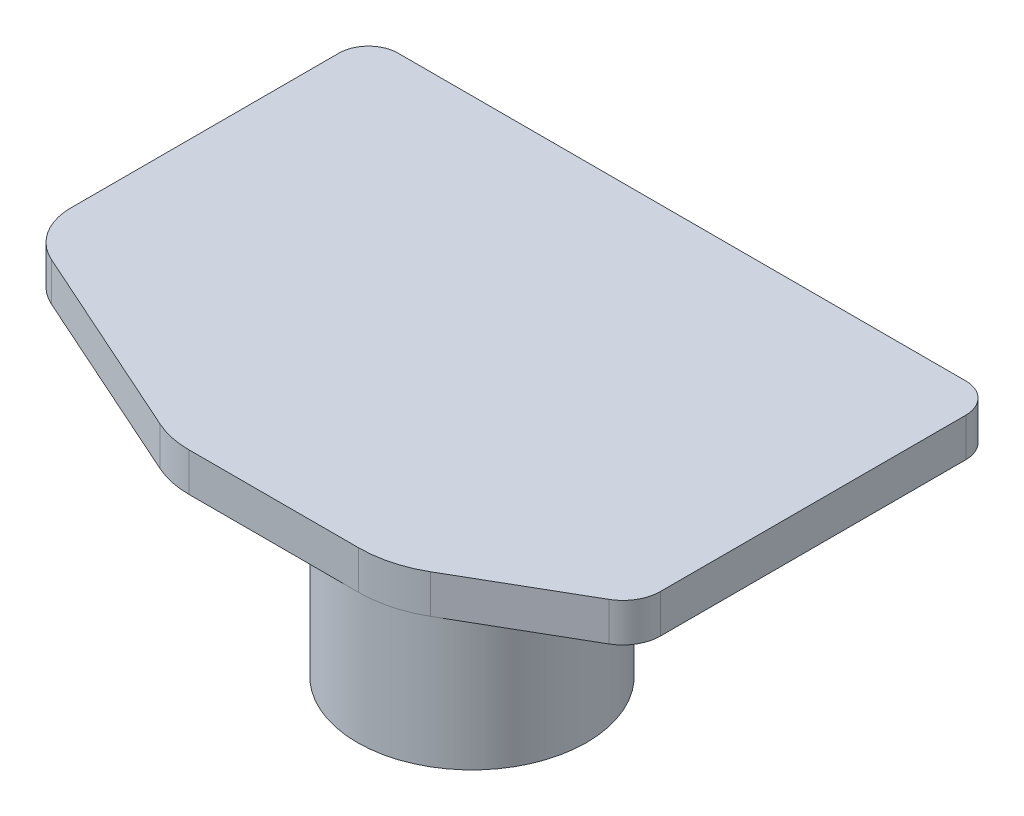
ISO-10303-21;
HEADER;
FILE_DESCRIPTION(('STEP AP214'),'2;1');
FILE_NAME('part.step','',(''),(''),'','','');
FILE_SCHEMA(('AUTOMOTIVE_DESIGN { 1 0 10303 214 1 1 1 1 }'));
ENDSEC;
DATA;
#1=APPLICATION_CONTEXT('core data for automotive mechanical design processes');
#2=APPLICATION_PROTOCOL_DEFINITION('international standard','automotive_design',2000,#1);
#3=PRODUCT_CONTEXT('',#1,'mechanical');
#4=PRODUCT('Part','Part','',(#3));
#5=PRODUCT_RELATED_PRODUCT_CATEGORY('part','',(#4));
#6=PRODUCT_DEFINITION_FORMATION('','',#4);
#7=PRODUCT_DEFINITION_CONTEXT('part definition',#1,'design');
#8=PRODUCT_DEFINITION('design','',#6,#7);
#9=PRODUCT_DEFINITION_SHAPE('','',#8);
#10=(LENGTH_UNIT() NAMED_UNIT(*) SI_UNIT(.MILLI.,.METRE.));
#11=(NAMED_UNIT(*) PLANE_ANGLE_UNIT() SI_UNIT($,.RADIAN.));
#12=(NAMED_UNIT(*) SI_UNIT($,.STERADIAN.) SOLID_ANGLE_UNIT());
#13=UNCERTAINTY_MEASURE_WITH_UNIT(LENGTH_MEASURE(1.E-05),#10,'distance_accuracy_value','');
#14=(GEOMETRIC_REPRESENTATION_CONTEXT(3) GLOBAL_UNCERTAINTY_ASSIGNED_CONTEXT((#13)) GLOBAL_UNIT_ASSIGNED_CONTEXT((#10,
#11,#12)) REPRESENTATION_CONTEXT('',''));
#15=CARTESIAN_POINT('',(0.,0.,0.));
#16=DIRECTION('',(0.,0.,1.));
#17=DIRECTION('',(1.,0.,0.));
#18=AXIS2_PLACEMENT_3D('',#15,#16,#17);
#19=CARTESIAN_POINT('',(125.767437510468,13.,37.5148890524214));
#20=DIRECTION('',(0.,-1.,0.));
#21=DIRECTION('',(0.,0.,-1.));
#22=AXIS2_PLACEMENT_3D('',#19,#20,#21);
#23=CYLINDRICAL_SURFACE('',#22,12.7000000000004);
#24=CARTESIAN_POINT('',(125.767437510468,0.,37.5148890524214));
#25=DIRECTION('',(0.,1.,0.));
#26=DIRECTION('',(0.,0.,1.));
#27=AXIS2_PLACEMENT_3D('',#24,#25,#26);
#28=CIRCLE('',#27,12.7000000000004);
#29=CARTESIAN_POINT('',(132.117437510468,0.,48.5134116804842));
#30=VERTEX_POINT('',#29);
#31=CARTESIAN_POINT('',(138.467437510469,0.,37.5148890524214));
#32=VERTEX_POINT('',#31);
#33=EDGE_CURVE('E158',#30,#32,#28,.T.);
#34=ORIENTED_EDGE('',*,*,#33,.T.);
#35=DIRECTION('',(0.,-1.,0.));
#36=VECTOR('',#35,1.);
#37=CARTESIAN_POINT('',(138.467437510469,13.,37.5148890524214));
#38=LINE('',#37,#36);
#39=CARTESIAN_POINT('',(138.467437510469,13.,37.5148890524214));
#40=VERTEX_POINT('',#39);
#41=EDGE_CURVE('E11',#40,#32,#38,.T.);
#42=ORIENTED_EDGE('',*,*,#41,.F.);
#43=CARTESIAN_POINT('',(125.767437510468,13.,37.5148890524214));
#44=DIRECTION('',(0.,1.,0.));
#45=DIRECTION('',(0.,0.,1.));
#46=AXIS2_PLACEMENT_3D('',#43,#44,#45);
#47=CIRCLE('',#46,12.7000000000004);
#48=CARTESIAN_POINT('',(132.117437510468,13.,48.5134116804842));
#49=VERTEX_POINT('',#48);
#50=EDGE_CURVE('E183',#49,#40,#47,.T.);
#51=ORIENTED_EDGE('',*,*,#50,.F.);
#52=DIRECTION('',(0.,-1.,0.));
#53=VECTOR('',#52,1.);
#54=CARTESIAN_POINT('',(132.117437510468,13.,48.5134116804842));
#55=LINE('',#54,#53);
#56=EDGE_CURVE('E154',#49,#30,#55,.T.);
#57=ORIENTED_EDGE('',*,*,#56,.T.);
#58=EDGE_LOOP('',(#34,#42,#51,#57));
#59=FACE_BOUND('',#58,.T.);
#60=ADVANCED_FACE('F32',(#59),#23,.T.);
#61=CARTESIAN_POINT('',(138.467437510469,13.,-65.1851109475786));
#62=DIRECTION('',(-1.,0.,0.));
#63=DIRECTION('',(0.,0.,1.));
#64=AXIS2_PLACEMENT_3D('',#61,#62,#63);
#65=PLANE('',#64);
#66=DIRECTION('',(0.,0.,-1.));
#67=VECTOR('',#66,1.);
#68=CARTESIAN_POINT('',(138.467437510469,0.,-65.1851109475786));
#69=LINE('',#68,#67);
#70=CARTESIAN_POINT('',(138.467437510469,0.,-65.1851109475786));
#71=VERTEX_POINT('',#70);
#72=EDGE_CURVE('E161',#32,#71,#69,.T.);
#73=ORIENTED_EDGE('',*,*,#72,.T.);
#74=DIRECTION('',(0.,-1.,0.));
#75=VECTOR('',#74,1.);
#76=CARTESIAN_POINT('',(138.467437510469,13.,-65.1851109475786));
#77=LINE('',#76,#75);
#78=CARTESIAN_POINT('',(138.467437510469,13.,-65.1851109475786));
#79=VERTEX_POINT('',#78);
#80=EDGE_CURVE('E39',#79,#71,#77,.T.);
#81=ORIENTED_EDGE('',*,*,#80,.F.);
#82=DIRECTION('',(0.,0.,-1.));
#83=VECTOR('',#82,1.);
#84=CARTESIAN_POINT('',(138.467437510469,13.,-65.1851109475786));
#85=LINE('',#84,#83);
#86=EDGE_CURVE('E104',#40,#79,#85,.T.);
#87=ORIENTED_EDGE('',*,*,#86,.F.);
#88=ORIENTED_EDGE('',*,*,#41,.T.);
#89=EDGE_LOOP('',(#73,#81,#87,#88));
#90=FACE_BOUND('',#89,.T.);
#91=ADVANCED_FACE('F256',(#90),#65,.F.);
#92=CARTESIAN_POINT('',(128.467437510469,13.,-65.1851109475786));
#93=DIRECTION('',(0.,-1.,0.));
#94=DIRECTION('',(0.,0.,-1.));
#95=AXIS2_PLACEMENT_3D('',#92,#93,#94);
#96=CYLINDRICAL_SURFACE('',#95,10.);
#97=CARTESIAN_POINT('',(128.467437510469,0.,-65.1851109475786));
#98=DIRECTION('',(0.,1.,0.));
#99=DIRECTION('',(0.,0.,1.));
#100=AXIS2_PLACEMENT_3D('',#97,#98,#99);
#101=CIRCLE('',#100,10.);
#102=CARTESIAN_POINT('',(128.467437510469,0.,-75.1851109475786));
#103=VERTEX_POINT('',#102);
#104=EDGE_CURVE('E164',#71,#103,#101,.T.);
#105=ORIENTED_EDGE('',*,*,#104,.T.);
#106=DIRECTION('',(0.,-1.,0.));
#107=VECTOR('',#106,1.);
#108=CARTESIAN_POINT('',(128.467437510469,13.,-75.1851109475786));
#109=LINE('',#108,#107);
#110=CARTESIAN_POINT('',(128.467437510469,13.,-75.1851109475786));
#111=VERTEX_POINT('',#110);
#112=EDGE_CURVE('E202',#111,#103,#109,.T.);
#113=ORIENTED_EDGE('',*,*,#112,.F.);
#114=CARTESIAN_POINT('',(128.467437510469,13.,-65.1851109475786));
#115=DIRECTION('',(0.,1.,0.));
#116=DIRECTION('',(0.,0.,1.));
#117=AXIS2_PLACEMENT_3D('',#114,#115,#116);
#118=CIRCLE('',#117,10.);
#119=EDGE_CURVE('E210',#79,#111,#118,.T.);
#120=ORIENTED_EDGE('',*,*,#119,.F.);
#121=ORIENTED_EDGE('',*,*,#80,.T.);
#122=EDGE_LOOP('',(#105,#113,#120,#121));
#123=FACE_BOUND('',#122,.T.);
#124=ADVANCED_FACE('F208',(#123),#96,.T.);
#125=CARTESIAN_POINT('',(-62.5325624895314,13.,-75.1851109475786));
#126=DIRECTION('',(0.,0.,1.));
#127=DIRECTION('',(1.,0.,0.));
#128=AXIS2_PLACEMENT_3D('',#125,#126,#127);
#129=PLANE('',#128);
#130=DIRECTION('',(-1.,0.,0.));
#131=VECTOR('',#130,1.);
#132=CARTESIAN_POINT('',(-62.5325624895314,0.,-75.1851109475786));
#133=LINE('',#132,#131);
#134=CARTESIAN_POINT('',(-62.5325624895314,0.,-75.1851109475786));
#135=VERTEX_POINT('',#134);
#136=EDGE_CURVE('E166',#103,#135,#133,.T.);
#137=ORIENTED_EDGE('',*,*,#136,.T.);
#138=DIRECTION('',(0.,-1.,0.));
#139=VECTOR('',#138,1.);
#140=CARTESIAN_POINT('',(-62.5325624895314,13.,-75.1851109475786));
#141=LINE('',#140,#139);
#142=CARTESIAN_POINT('',(-62.5325624895314,13.,-75.1851109475786));
#143=VERTEX_POINT('',#142);
#144=EDGE_CURVE('E199',#143,#135,#141,.T.);
#145=ORIENTED_EDGE('',*,*,#144,.F.);
#146=DIRECTION('',(-1.,0.,0.));
#147=VECTOR('',#146,1.);
#148=CARTESIAN_POINT('',(-62.5325624895314,13.,-75.1851109475786));
#149=LINE('',#148,#147);
#150=EDGE_CURVE('E228',#111,#143,#149,.T.);
#151=ORIENTED_EDGE('',*,*,#150,.F.);
#152=ORIENTED_EDGE('',*,*,#112,.T.);
#153=EDGE_LOOP('',(#137,#145,#151,#152));
#154=FACE_BOUND('',#153,.T.);
#155=ADVANCED_FACE('F219',(#154),#129,.F.);
#156=CARTESIAN_POINT('',(-62.5325624895314,13.,-65.1851109475786));
#157=DIRECTION('',(0.,-1.,0.));
#158=DIRECTION('',(0.,0.,-1.));
#159=AXIS2_PLACEMENT_3D('',#156,#157,#158);
#160=CYLINDRICAL_SURFACE('',#159,10.);
#161=CARTESIAN_POINT('',(-62.5325624895314,0.,-65.1851109475786));
#162=DIRECTION('',(0.,1.,0.));
#163=DIRECTION('',(0.,0.,-1.));
#164=AXIS2_PLACEMENT_3D('',#161,#162,#163);
#165=CIRCLE('',#164,10.);
#166=CARTESIAN_POINT('',(-72.5325624895314,0.,-65.1851109475786));
#167=VERTEX_POINT('',#166);
#168=EDGE_CURVE('E168',#135,#167,#165,.T.);
#169=ORIENTED_EDGE('',*,*,#168,.T.);
#170=DIRECTION('',(0.,-1.,0.));
#171=VECTOR('',#170,1.);
#172=CARTESIAN_POINT('',(-72.5325624895314,13.,-65.1851109475786));
#173=LINE('',#172,#171);
#174=CARTESIAN_POINT('',(-72.5325624895314,13.,-65.1851109475786));
#175=VERTEX_POINT('',#174);
#176=EDGE_CURVE('E196',#175,#167,#173,.T.);
#177=ORIENTED_EDGE('',*,*,#176,.F.);
#178=CARTESIAN_POINT('',(-62.5325624895314,13.,-65.1851109475786));
#179=DIRECTION('',(0.,1.,0.));
#180=DIRECTION('',(0.,0.,-1.));
#181=AXIS2_PLACEMENT_3D('',#178,#179,#180);
#182=CIRCLE('',#181,10.);
#183=EDGE_CURVE('E225',#143,#175,#182,.T.);
#184=ORIENTED_EDGE('',*,*,#183,.F.);
#185=ORIENTED_EDGE('',*,*,#144,.T.);
#186=EDGE_LOOP('',(#169,#177,#184,#185));
#187=FACE_BOUND('',#186,.T.);
#188=ADVANCED_FACE('F223',(#187),#160,.T.);
#189=CARTESIAN_POINT('',(-72.5325624895314,13.,-65.1851109475786));
#190=DIRECTION('',(1.,0.,0.));
#191=DIRECTION('',(0.,0.,-1.));
#192=AXIS2_PLACEMENT_3D('',#189,#190,#191);
#193=PLANE('',#192);
#194=DIRECTION('',(0.,0.,1.));
#195=VECTOR('',#194,1.);
#196=CARTESIAN_POINT('',(-72.5325624895314,0.,-65.1851109475786));
#197=LINE('',#196,#195);
#198=CARTESIAN_POINT('',(-72.5325624895314,0.,25.0665051444108));
#199=VERTEX_POINT('',#198);
#200=EDGE_CURVE('E170',#167,#199,#197,.T.);
#201=ORIENTED_EDGE('',*,*,#200,.T.);
#202=DIRECTION('',(0.,-1.,0.));
#203=VECTOR('',#202,1.);
#204=CARTESIAN_POINT('',(-72.5325624895314,13.,25.0665051444108));
#205=LINE('',#204,#203);
#206=CARTESIAN_POINT('',(-72.5325624895314,13.,25.0665051444108));
#207=VERTEX_POINT('',#206);
#208=EDGE_CURVE('E193',#207,#199,#205,.T.);
#209=ORIENTED_EDGE('',*,*,#208,.F.);
#210=DIRECTION('',(0.,0.,1.));
#211=VECTOR('',#210,1.);
#212=CARTESIAN_POINT('',(-72.5325624895314,13.,-65.1851109475786));
#213=LINE('',#212,#211);
#214=EDGE_CURVE('E227',#175,#207,#213,.T.);
#215=ORIENTED_EDGE('',*,*,#214,.F.);
#216=ORIENTED_EDGE('',*,*,#176,.T.);
#217=EDGE_LOOP('',(#201,#209,#215,#216));
#218=FACE_BOUND('',#217,.T.);
#219=ADVANCED_FACE('F268',(#218),#193,.F.);
#220=CARTESIAN_POINT('',(-52.5325624895314,13.,25.0665051444108));
#221=DIRECTION('',(0.,-1.,0.));
#222=DIRECTION('',(0.,0.,-1.));
#223=AXIS2_PLACEMENT_3D('',#220,#221,#222);
#224=CYLINDRICAL_SURFACE('',#223,20.);
#225=CARTESIAN_POINT('',(-52.5325624895314,0.,25.0665051444108));
#226=DIRECTION('',(0.,1.,0.));
#227=DIRECTION('',(0.,0.,-1.));
#228=AXIS2_PLACEMENT_3D('',#225,#226,#227);
#229=CIRCLE('',#228,20.);
#230=CARTESIAN_POINT('',(-60.7070209473384,0.,43.3196755244184));
#231=VERTEX_POINT('',#230);
#232=EDGE_CURVE('E172',#199,#231,#229,.T.);
#233=ORIENTED_EDGE('',*,*,#232,.T.);
#234=DIRECTION('',(0.,-1.,0.));
#235=VECTOR('',#234,1.);
#236=CARTESIAN_POINT('',(-60.7070209473384,13.,43.3196755244184));
#237=LINE('',#236,#235);
#238=CARTESIAN_POINT('',(-60.7070209473384,13.,43.3196755244184));
#239=VERTEX_POINT('',#238);
#240=EDGE_CURVE('E190',#239,#231,#237,.T.);
#241=ORIENTED_EDGE('',*,*,#240,.F.);
#242=CARTESIAN_POINT('',(-52.5325624895314,13.,25.0665051444108));
#243=DIRECTION('',(0.,1.,0.));
#244=DIRECTION('',(0.,0.,-1.));
#245=AXIS2_PLACEMENT_3D('',#242,#243,#244);
#246=CIRCLE('',#245,20.);
#247=EDGE_CURVE('E230',#207,#239,#246,.T.);
#248=ORIENTED_EDGE('',*,*,#247,.F.);
#249=ORIENTED_EDGE('',*,*,#208,.T.);
#250=EDGE_LOOP('',(#233,#241,#248,#249));
#251=FACE_BOUND('',#250,.T.);
#252=ADVANCED_FACE('F271',(#251),#224,.T.);
#253=CARTESIAN_POINT('',(-60.7070209473384,13.,43.3196755244184));
#254=DIRECTION('',(0.408722922890351,0.,-0.91265851900038));
#255=DIRECTION('',(-0.912658519000381,0.,-0.408722922890352));
#256=AXIS2_PLACEMENT_3D('',#253,#254,#255);
#257=PLANE('',#256);
#258=DIRECTION('',(0.91265851900038,0.,0.408722922890351));
#259=VECTOR('',#258,1.);
#260=CARTESIAN_POINT('',(-60.7070209473384,0.,43.3196755244184));
#261=LINE('',#260,#259);
#262=CARTESIAN_POINT('',(5.555749823758,0.,72.9946446224329));
#263=VERTEX_POINT('',#262);
#264=EDGE_CURVE('E174',#231,#263,#261,.T.);
#265=ORIENTED_EDGE('',*,*,#264,.T.);
#266=DIRECTION('',(0.,-1.,0.));
#267=VECTOR('',#266,1.);
#268=CARTESIAN_POINT('',(5.555749823758,13.,72.9946446224329));
#269=LINE('',#268,#267);
#270=CARTESIAN_POINT('',(5.555749823758,13.,72.9946446224329));
#271=VERTEX_POINT('',#270);
#272=EDGE_CURVE('E187',#271,#263,#269,.T.);
#273=ORIENTED_EDGE('',*,*,#272,.F.);
#274=DIRECTION('',(0.91265851900038,0.,0.408722922890351));
#275=VECTOR('',#274,1.);
#276=CARTESIAN_POINT('',(-60.7070209473384,13.,43.3196755244184));
#277=LINE('',#276,#275);
#278=EDGE_CURVE('E236',#239,#271,#277,.T.);
#279=ORIENTED_EDGE('',*,*,#278,.F.);
#280=ORIENTED_EDGE('',*,*,#240,.T.);
#281=EDGE_LOOP('',(#265,#273,#279,#280));
#282=FACE_BOUND('',#281,.T.);
#283=ADVANCED_FACE('F242',(#282),#257,.F.);
#284=CARTESIAN_POINT('',(17.8174375104681,13.,45.6148890524214));
#285=DIRECTION('',(0.,-1.,0.));
#286=DIRECTION('',(0.,0.,-1.));
#287=AXIS2_PLACEMENT_3D('',#284,#285,#286);
#288=CYLINDRICAL_SURFACE('',#287,29.9999999999999);
#289=CARTESIAN_POINT('',(17.8174375104681,0.,45.6148890524214));
#290=DIRECTION('',(0.,1.,0.));
#291=DIRECTION('',(0.,0.,-1.));
#292=AXIS2_PLACEMENT_3D('',#289,#290,#291);
#293=CIRCLE('',#292,29.9999999999999);
#294=CARTESIAN_POINT('',(17.8174375104686,0.,75.6148890524213));
#295=VERTEX_POINT('',#294);
#296=EDGE_CURVE('E176',#263,#295,#293,.T.);
#297=ORIENTED_EDGE('',*,*,#296,.T.);
#298=DIRECTION('',(0.,-1.,0.));
#299=VECTOR('',#298,1.);
#300=CARTESIAN_POINT('',(17.8174375104686,13.,75.6148890524213));
#301=LINE('',#300,#299);
#302=CARTESIAN_POINT('',(17.8174375104686,13.,75.6148890524213));
#303=VERTEX_POINT('',#302);
#304=EDGE_CURVE('E149',#303,#295,#301,.T.);
#305=ORIENTED_EDGE('',*,*,#304,.F.);
#306=CARTESIAN_POINT('',(17.8174375104681,13.,45.6148890524214));
#307=DIRECTION('',(0.,1.,0.));
#308=DIRECTION('',(0.,0.,-1.));
#309=AXIS2_PLACEMENT_3D('',#306,#307,#308);
#310=CIRCLE('',#309,29.9999999999999);
#311=EDGE_CURVE('E136',#271,#303,#310,.T.);
#312=ORIENTED_EDGE('',*,*,#311,.F.);
#313=ORIENTED_EDGE('',*,*,#272,.T.);
#314=EDGE_LOOP('',(#297,#305,#312,#313));
#315=FACE_BOUND('',#314,.T.);
#316=ADVANCED_FACE('F246',(#315),#288,.T.);
#317=CARTESIAN_POINT('',(17.8174375104686,13.,75.6148890524213));
#318=DIRECTION('',(0.,0.,-1.));
#319=DIRECTION('',(-1.,0.,0.));
#320=AXIS2_PLACEMENT_3D('',#317,#318,#319);
#321=PLANE('',#320);
#322=DIRECTION('',(1.,0.,0.));
#323=VECTOR('',#322,1.);
#324=CARTESIAN_POINT('',(17.8174375104686,0.,75.6148890524213));
#325=LINE('',#324,#323);
#326=CARTESIAN_POINT('',(74.4674375104686,0.,75.6148890524213));
#327=VERTEX_POINT('',#326);
#328=EDGE_CURVE('E178',#295,#327,#325,.T.);
#329=ORIENTED_EDGE('',*,*,#328,.T.);
#330=CARTESIAN_POINT('',(74.9674375104686,0.,75.6148890524214));
#331=VERTEX_POINT('',#330);
#332=EDGE_CURVE('E146',#327,#331,#325,.T.);
#333=ORIENTED_EDGE('',*,*,#332,.T.);
#334=DIRECTION('',(0.,-1.,0.));
#335=VECTOR('',#334,1.);
#336=CARTESIAN_POINT('',(74.9674375104686,13.,75.6148890524214));
#337=LINE('',#336,#335);
#338=CARTESIAN_POINT('',(74.9674375104686,13.,75.6148890524214));
#339=VERTEX_POINT('',#338);
#340=EDGE_CURVE('E142',#339,#331,#337,.T.);
#341=ORIENTED_EDGE('',*,*,#340,.F.);
#342=DIRECTION('',(1.,0.,0.));
#343=VECTOR('',#342,1.);
#344=CARTESIAN_POINT('',(17.8174375104686,13.,75.6148890524213));
#345=LINE('',#344,#343);
#346=EDGE_CURVE('E129',#303,#339,#345,.T.);
#347=ORIENTED_EDGE('',*,*,#346,.F.);
#348=ORIENTED_EDGE('',*,*,#304,.T.);
#349=EDGE_LOOP('',(#329,#333,#341,#347,#348));
#350=FACE_BOUND('',#349,.T.);
#351=ADVANCED_FACE('F144',(#350),#321,.F.);
#352=CARTESIAN_POINT('',(74.9674375104681,13.,37.5148890524214));
#353=DIRECTION('',(0.,-1.,0.));
#354=DIRECTION('',(0.,0.,-1.));
#355=AXIS2_PLACEMENT_3D('',#352,#353,#354);
#356=CYLINDRICAL_SURFACE('',#355,38.1);
#357=CARTESIAN_POINT('',(74.9674375104681,0.,37.5148890524214));
#358=DIRECTION('',(0.,1.,0.));
#359=DIRECTION('',(0.,0.,1.));
#360=AXIS2_PLACEMENT_3D('',#357,#358,#359);
#361=CIRCLE('',#360,38.1);
#362=CARTESIAN_POINT('',(94.0174375104679,0.,70.5104569366086));
#363=VERTEX_POINT('',#362);
#364=EDGE_CURVE('E180',#331,#363,#361,.T.);
#365=ORIENTED_EDGE('',*,*,#364,.T.);
#366=DIRECTION('',(0.,-1.,0.));
#367=VECTOR('',#366,1.);
#368=CARTESIAN_POINT('',(94.0174375104679,13.,70.5104569366086));
#369=LINE('',#368,#367);
#370=CARTESIAN_POINT('',(94.0174375104679,13.,70.5104569366086));
#371=VERTEX_POINT('',#370);
#372=EDGE_CURVE('E150',#371,#363,#369,.T.);
#373=ORIENTED_EDGE('',*,*,#372,.F.);
#374=CARTESIAN_POINT('',(74.9674375104681,13.,37.5148890524214));
#375=DIRECTION('',(0.,1.,0.));
#376=DIRECTION('',(0.,0.,1.));
#377=AXIS2_PLACEMENT_3D('',#374,#375,#376);
#378=CIRCLE('',#377,38.1);
#379=EDGE_CURVE('E133',#339,#371,#378,.T.);
#380=ORIENTED_EDGE('',*,*,#379,.F.);
#381=ORIENTED_EDGE('',*,*,#340,.T.);
#382=EDGE_LOOP('',(#365,#373,#380,#381));
#383=FACE_BOUND('',#382,.T.);
#384=ADVANCED_FACE('F152',(#383),#356,.T.);
#385=CARTESIAN_POINT('',(132.117437510468,13.,48.5134116804842));
#386=DIRECTION('',(-0.499999999999995,0.,-0.866025403784442));
#387=DIRECTION('',(-0.866025403784442,0.,0.499999999999995));
#388=AXIS2_PLACEMENT_3D('',#385,#386,#387);
#389=PLANE('',#388);
#390=DIRECTION('',(0.866025403784442,0.,-0.499999999999995));
#391=VECTOR('',#390,1.);
#392=CARTESIAN_POINT('',(132.117437510468,0.,48.5134116804842));
#393=LINE('',#392,#391);
#394=EDGE_CURVE('E96',#363,#30,#393,.T.);
#395=ORIENTED_EDGE('',*,*,#394,.T.);
#396=ORIENTED_EDGE('',*,*,#56,.F.);
#397=DIRECTION('',(0.866025403784442,0.,-0.499999999999995));
#398=VECTOR('',#397,1.);
#399=CARTESIAN_POINT('',(132.117437510468,13.,48.5134116804842));
#400=LINE('',#399,#398);
#401=EDGE_CURVE('E52',#371,#49,#400,.T.);
#402=ORIENTED_EDGE('',*,*,#401,.F.);
#403=ORIENTED_EDGE('',*,*,#372,.T.);
#404=EDGE_LOOP('',(#395,#396,#402,#403));
#405=FACE_BOUND('',#404,.T.);
#406=ADVANCED_FACE('F284',(#405),#389,.F.);
#407=CARTESIAN_POINT('',(125.767437510468,13.,37.5148890524214));
#408=DIRECTION('',(0.,1.,0.));
#409=DIRECTION('',(0.,0.,1.));
#410=AXIS2_PLACEMENT_3D('',#407,#408,#409);
#411=PLANE('',#410);
#412=ORIENTED_EDGE('',*,*,#50,.T.);
#413=ORIENTED_EDGE('',*,*,#86,.T.);
#414=ORIENTED_EDGE('',*,*,#119,.T.);
#415=ORIENTED_EDGE('',*,*,#150,.T.);
#416=ORIENTED_EDGE('',*,*,#183,.T.);
#417=ORIENTED_EDGE('',*,*,#214,.T.);
#418=ORIENTED_EDGE('',*,*,#247,.T.);
#419=ORIENTED_EDGE('',*,*,#278,.T.);
#420=ORIENTED_EDGE('',*,*,#311,.T.);
#421=ORIENTED_EDGE('',*,*,#346,.T.);
#422=ORIENTED_EDGE('',*,*,#379,.T.);
#423=ORIENTED_EDGE('',*,*,#401,.T.);
#424=EDGE_LOOP('',(#412,#413,#414,#415,#416,#417,#418,#419,#420,#421,#422,#423));
#425=FACE_BOUND('',#424,.T.);
#426=ADVANCED_FACE('F131',(#425),#411,.T.);
#427=CARTESIAN_POINT('',(125.767437510468,0.,37.5148890524214));
#428=DIRECTION('',(0.,1.,0.));
#429=DIRECTION('',(0.,0.,1.));
#430=AXIS2_PLACEMENT_3D('',#427,#428,#429);
#431=PLANE('',#430);
#432=ORIENTED_EDGE('',*,*,#332,.F.);
#433=CARTESIAN_POINT('',(74.4674375104686,0.,37.));
#434=DIRECTION('',(0.,1.,0.));
#435=DIRECTION('',(0.,0.,1.));
#436=AXIS2_PLACEMENT_3D('',#433,#434,#435);
#437=CIRCLE('',#436,38.6148890524214);
#438=EDGE_CURVE('E44',#327,#327,#437,.T.);
#439=ORIENTED_EDGE('',*,*,#438,.T.);
#440=ORIENTED_EDGE('',*,*,#328,.F.);
#441=ORIENTED_EDGE('',*,*,#296,.F.);
#442=ORIENTED_EDGE('',*,*,#264,.F.);
#443=ORIENTED_EDGE('',*,*,#232,.F.);
#444=ORIENTED_EDGE('',*,*,#200,.F.);
#445=ORIENTED_EDGE('',*,*,#168,.F.);
#446=ORIENTED_EDGE('',*,*,#136,.F.);
#447=ORIENTED_EDGE('',*,*,#104,.F.);
#448=ORIENTED_EDGE('',*,*,#72,.F.);
#449=ORIENTED_EDGE('',*,*,#33,.F.);
#450=ORIENTED_EDGE('',*,*,#394,.F.);
#451=ORIENTED_EDGE('',*,*,#364,.F.);
#452=EDGE_LOOP('',(#432,#439,#440,#441,#442,#443,#444,#445,#446,#447,#448,#449,#450,#451));
#453=FACE_BOUND('',#452,.T.);
#454=ADVANCED_FACE('F213',(#453),#431,.F.);
#455=CARTESIAN_POINT('',(74.4674375104686,-44.,37.));
#456=DIRECTION('',(0.,1.,0.));
#457=DIRECTION('',(0.,0.,1.));
#458=AXIS2_PLACEMENT_3D('',#455,#456,#457);
#459=CYLINDRICAL_SURFACE('',#458,38.6148890524214);
#460=CARTESIAN_POINT('',(74.4674375104686,-44.,37.));
#461=DIRECTION('',(0.,1.,0.));
#462=DIRECTION('',(0.,0.,1.));
#463=AXIS2_PLACEMENT_3D('',#460,#461,#462);
#464=CIRCLE('',#463,38.6148890524214);
#465=CARTESIAN_POINT('',(74.4674375104686,-44.,75.6148890524214));
#466=VERTEX_POINT('',#465);
#467=EDGE_CURVE('E162',#466,#466,#464,.T.);
#468=ORIENTED_EDGE('',*,*,#467,.T.);
#469=EDGE_LOOP('',(#468));
#470=FACE_BOUND('',#469,.T.);
#471=ORIENTED_EDGE('',*,*,#438,.F.);
#472=EDGE_LOOP('',(#471));
#473=FACE_BOUND('',#472,.T.);
#474=ADVANCED_FACE('F289',(#470,#473),#459,.T.);
#475=CARTESIAN_POINT('',(74.4674375104686,-44.,37.));
#476=DIRECTION('',(0.,1.,0.));
#477=DIRECTION('',(0.,0.,1.));
#478=AXIS2_PLACEMENT_3D('',#475,#476,#477);
#479=PLANE('',#478);
#480=ORIENTED_EDGE('',*,*,#467,.F.);
#481=EDGE_LOOP('',(#480));
#482=FACE_BOUND('',#481,.T.);
#483=ADVANCED_FACE('F294',(#482),#479,.F.);
#484=CLOSED_SHELL('',(#60,#91,#124,#155,#188,#219,#252,#283,#316,#351,#384,#406,#426,#454,#474,#483));
#485=MANIFOLD_SOLID_BREP('B2',#484);
#486=ADVANCED_BREP_SHAPE_REPRESENTATION('',(#18,#485),#14);
#487=SHAPE_DEFINITION_REPRESENTATION(#9,#486);
ENDSEC;
END-ISO-10303-21;
